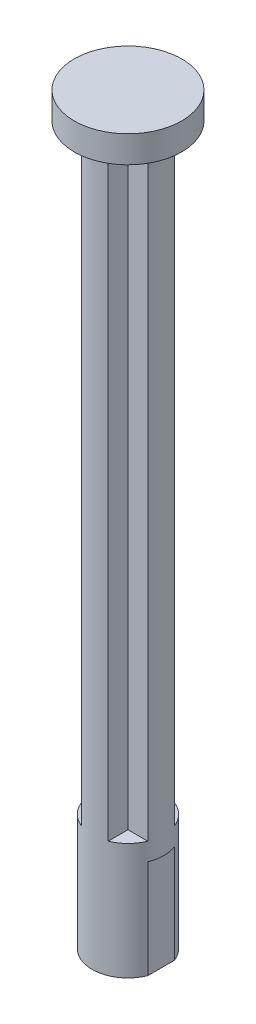
ISO-10303-21;
HEADER;
FILE_DESCRIPTION(('STEP AP214'),'2;1');
FILE_NAME('part.step','',(''),(''),'','','');
FILE_SCHEMA(('AUTOMOTIVE_DESIGN { 1 0 10303 214 1 1 1 1 }'));
ENDSEC;
DATA;
#1=APPLICATION_CONTEXT('core data for automotive mechanical design processes');
#2=APPLICATION_PROTOCOL_DEFINITION('international standard','automotive_design',2000,#1);
#3=PRODUCT_CONTEXT('',#1,'mechanical');
#4=PRODUCT('Part','Part','',(#3));
#5=PRODUCT_RELATED_PRODUCT_CATEGORY('part','',(#4));
#6=PRODUCT_DEFINITION_FORMATION('','',#4);
#7=PRODUCT_DEFINITION_CONTEXT('part definition',#1,'design');
#8=PRODUCT_DEFINITION('design','',#6,#7);
#9=PRODUCT_DEFINITION_SHAPE('','',#8);
#10=(LENGTH_UNIT() NAMED_UNIT(*) SI_UNIT(.MILLI.,.METRE.));
#11=(NAMED_UNIT(*) PLANE_ANGLE_UNIT() SI_UNIT($,.RADIAN.));
#12=(NAMED_UNIT(*) SI_UNIT($,.STERADIAN.) SOLID_ANGLE_UNIT());
#13=UNCERTAINTY_MEASURE_WITH_UNIT(LENGTH_MEASURE(1.E-05),#10,'distance_accuracy_value','');
#14=(GEOMETRIC_REPRESENTATION_CONTEXT(3) GLOBAL_UNCERTAINTY_ASSIGNED_CONTEXT((#13)) GLOBAL_UNIT_ASSIGNED_CONTEXT((#10,
#11,#12)) REPRESENTATION_CONTEXT('',''));
#15=CARTESIAN_POINT('',(0.,0.,0.));
#16=DIRECTION('',(0.,0.,1.));
#17=DIRECTION('',(1.,0.,0.));
#18=AXIS2_PLACEMENT_3D('',#15,#16,#17);
#19=CARTESIAN_POINT('',(0.,13.,0.));
#20=DIRECTION('',(0.,1.,0.));
#21=DIRECTION('',(0.,0.,1.));
#22=AXIS2_PLACEMENT_3D('',#19,#20,#21);
#23=PLANE('',#22);
#24=DIRECTION('',(0.,0.,-1.));
#25=VECTOR('',#24,1.);
#26=CARTESIAN_POINT('',(1.50000000000001,13.,-1.49999999999999));
#27=LINE('',#26,#25);
#28=CARTESIAN_POINT('',(1.50000000000001,13.,-1.49999999999999));
#29=VERTEX_POINT('',#28);
#30=CARTESIAN_POINT('',(1.50000000000001,13.,-3.70809924354782));
#31=VERTEX_POINT('',#30);
#32=EDGE_CURVE('E59',#29,#31,#27,.T.);
#33=ORIENTED_EDGE('',*,*,#32,.F.);
#34=DIRECTION('',(-1.,0.,0.));
#35=VECTOR('',#34,1.);
#36=CARTESIAN_POINT('',(1.50000000000001,13.,-1.49999999999999));
#37=LINE('',#36,#35);
#38=CARTESIAN_POINT('',(3.70809924354784,13.,-1.49999999999997));
#39=VERTEX_POINT('',#38);
#40=EDGE_CURVE('E223',#39,#29,#37,.T.);
#41=ORIENTED_EDGE('',*,*,#40,.F.);
#42=CARTESIAN_POINT('',(0.,13.,0.));
#43=DIRECTION('',(0.,1.,0.));
#44=DIRECTION('',(0.,0.,1.));
#45=AXIS2_PLACEMENT_3D('',#42,#43,#44);
#46=CIRCLE('',#45,4.);
#47=EDGE_CURVE('E310',#39,#31,#46,.T.);
#48=ORIENTED_EDGE('',*,*,#47,.T.);
#49=EDGE_LOOP('',(#33,#41,#48));
#50=FACE_BOUND('',#49,.T.);
#51=ADVANCED_FACE('F43',(#50),#23,.T.);
#52=DIRECTION('',(1.,0.,0.));
#53=VECTOR('',#52,1.);
#54=CARTESIAN_POINT('',(1.49999999999998,13.,1.50000000000001));
#55=LINE('',#54,#53);
#56=CARTESIAN_POINT('',(1.49999999999998,13.,1.50000000000001));
#57=VERTEX_POINT('',#56);
#58=CARTESIAN_POINT('',(3.70809924354782,13.,1.50000000000003));
#59=VERTEX_POINT('',#58);
#60=EDGE_CURVE('E67',#57,#59,#55,.T.);
#61=ORIENTED_EDGE('',*,*,#60,.F.);
#62=DIRECTION('',(0.,0.,-1.));
#63=VECTOR('',#62,1.);
#64=CARTESIAN_POINT('',(1.49999999999998,13.,1.50000000000001));
#65=LINE('',#64,#63);
#66=CARTESIAN_POINT('',(1.49999999999996,13.,3.70809924354785));
#67=VERTEX_POINT('',#66);
#68=EDGE_CURVE('E218',#67,#57,#65,.T.);
#69=ORIENTED_EDGE('',*,*,#68,.F.);
#70=EDGE_CURVE('E306',#67,#59,#46,.T.);
#71=ORIENTED_EDGE('',*,*,#70,.T.);
#72=EDGE_LOOP('',(#61,#69,#71));
#73=FACE_BOUND('',#72,.T.);
#74=ADVANCED_FACE('F403',(#73),#23,.T.);
#75=DIRECTION('',(0.,0.,1.));
#76=VECTOR('',#75,1.);
#77=CARTESIAN_POINT('',(-1.50000000000002,13.,1.5));
#78=LINE('',#77,#76);
#79=CARTESIAN_POINT('',(-1.50000000000002,13.,1.5));
#80=VERTEX_POINT('',#79);
#81=CARTESIAN_POINT('',(-1.50000000000004,13.,3.70809924354781));
#82=VERTEX_POINT('',#81);
#83=EDGE_CURVE('E214',#80,#82,#78,.T.);
#84=ORIENTED_EDGE('',*,*,#83,.F.);
#85=DIRECTION('',(1.,0.,0.));
#86=VECTOR('',#85,1.);
#87=CARTESIAN_POINT('',(-1.50000000000002,13.,1.5));
#88=LINE('',#87,#86);
#89=CARTESIAN_POINT('',(-3.70809924354783,13.,1.5));
#90=VERTEX_POINT('',#89);
#91=EDGE_CURVE('E210',#90,#80,#88,.T.);
#92=ORIENTED_EDGE('',*,*,#91,.F.);
#93=EDGE_CURVE('E311',#90,#82,#46,.T.);
#94=ORIENTED_EDGE('',*,*,#93,.T.);
#95=EDGE_LOOP('',(#84,#92,#94));
#96=FACE_BOUND('',#95,.T.);
#97=ADVANCED_FACE('F409',(#96),#23,.T.);
#98=CARTESIAN_POINT('',(-3.70809924354783,11.,-1.5));
#99=DIRECTION('',(1.,0.,0.));
#100=DIRECTION('',(0.,0.,-1.));
#101=AXIS2_PLACEMENT_3D('',#98,#99,#100);
#102=PLANE('',#101);
#103=DIRECTION('',(0.,-1.,0.));
#104=VECTOR('',#103,1.);
#105=CARTESIAN_POINT('',(-3.70809924354783,11.,-1.5));
#106=LINE('',#105,#104);
#107=CARTESIAN_POINT('',(-3.70809924354783,11.,-1.5));
#108=VERTEX_POINT('',#107);
#109=CARTESIAN_POINT('',(-3.70809924354783,5.,-1.5));
#110=VERTEX_POINT('',#109);
#111=EDGE_CURVE('E284',#108,#110,#106,.T.);
#112=ORIENTED_EDGE('',*,*,#111,.T.);
#113=CARTESIAN_POINT('',(-3.70809924354783,5.,0.));
#114=DIRECTION('',(-1.,0.,0.));
#115=DIRECTION('',(0.,0.,1.));
#116=AXIS2_PLACEMENT_3D('',#113,#114,#115);
#117=CIRCLE('',#116,1.5);
#118=CARTESIAN_POINT('',(-3.70809924354783,5.,1.5));
#119=VERTEX_POINT('',#118);
#120=EDGE_CURVE('E267',#119,#110,#117,.T.);
#121=ORIENTED_EDGE('',*,*,#120,.F.);
#122=DIRECTION('',(0.,-1.,0.));
#123=VECTOR('',#122,1.);
#124=CARTESIAN_POINT('',(-3.70809924354783,11.,1.5));
#125=LINE('',#124,#123);
#126=CARTESIAN_POINT('',(-3.70809924354783,11.,1.5));
#127=VERTEX_POINT('',#126);
#128=EDGE_CURVE('E289',#127,#119,#125,.T.);
#129=ORIENTED_EDGE('',*,*,#128,.F.);
#130=DIRECTION('',(0.,0.,1.));
#131=VECTOR('',#130,1.);
#132=CARTESIAN_POINT('',(-3.70809924354783,11.,-1.5));
#133=LINE('',#132,#131);
#134=EDGE_CURVE('E278',#108,#127,#133,.T.);
#135=ORIENTED_EDGE('',*,*,#134,.F.);
#136=EDGE_LOOP('',(#112,#121,#129,#135));
#137=FACE_BOUND('',#136,.T.);
#138=ADVANCED_FACE('F417',(#137),#102,.F.);
#139=CARTESIAN_POINT('',(0.,13.,0.));
#140=DIRECTION('',(0.,-1.,0.));
#141=DIRECTION('',(0.,0.,-1.));
#142=AXIS2_PLACEMENT_3D('',#139,#140,#141);
#143=CYLINDRICAL_SURFACE('',#142,4.);
#144=ORIENTED_EDGE('',*,*,#70,.F.);
#145=DIRECTION('',(0.,-1.,0.));
#146=VECTOR('',#145,1.);
#147=CARTESIAN_POINT('',(1.49999999999996,80.,3.70809924354784));
#148=LINE('',#147,#146);
#149=CARTESIAN_POINT('',(1.49999999999996,80.,3.70809924354784));
#150=VERTEX_POINT('',#149);
#151=EDGE_CURVE('E246',#150,#67,#148,.T.);
#152=ORIENTED_EDGE('',*,*,#151,.F.);
#153=CARTESIAN_POINT('',(0.,80.,0.));
#154=DIRECTION('',(0.,1.,0.));
#155=DIRECTION('',(0.,0.,1.));
#156=AXIS2_PLACEMENT_3D('',#153,#154,#155);
#157=CIRCLE('',#156,4.);
#158=CARTESIAN_POINT('',(-1.50000000000004,80.,3.70809924354781));
#159=VERTEX_POINT('',#158);
#160=EDGE_CURVE('E361',#159,#150,#157,.T.);
#161=ORIENTED_EDGE('',*,*,#160,.F.);
#162=DIRECTION('',(0.,-1.,0.));
#163=VECTOR('',#162,1.);
#164=CARTESIAN_POINT('',(-1.50000000000004,80.,3.70809924354781));
#165=LINE('',#164,#163);
#166=EDGE_CURVE('E250',#159,#82,#165,.T.);
#167=ORIENTED_EDGE('',*,*,#166,.T.);
#168=ORIENTED_EDGE('',*,*,#93,.F.);
#169=DIRECTION('',(0.,-1.,0.));
#170=VECTOR('',#169,1.);
#171=CARTESIAN_POINT('',(-3.70809924354783,80.,1.5));
#172=LINE('',#171,#170);
#173=CARTESIAN_POINT('',(-3.70809924354783,80.,1.5));
#174=VERTEX_POINT('',#173);
#175=EDGE_CURVE('E258',#174,#90,#172,.T.);
#176=ORIENTED_EDGE('',*,*,#175,.F.);
#177=CARTESIAN_POINT('',(0.,80.,0.));
#178=DIRECTION('',(0.,1.,0.));
#179=DIRECTION('',(0.,0.,1.));
#180=AXIS2_PLACEMENT_3D('',#177,#178,#179);
#181=CIRCLE('',#180,4.);
#182=CARTESIAN_POINT('',(-3.70809924354783,80.,-1.5));
#183=VERTEX_POINT('',#182);
#184=EDGE_CURVE('E375',#183,#174,#181,.T.);
#185=ORIENTED_EDGE('',*,*,#184,.F.);
#186=DIRECTION('',(0.,-1.,0.));
#187=VECTOR('',#186,1.);
#188=CARTESIAN_POINT('',(-3.70809924354783,80.,-1.5));
#189=LINE('',#188,#187);
#190=CARTESIAN_POINT('',(-3.70809924354783,13.,-1.5));
#191=VERTEX_POINT('',#190);
#192=EDGE_CURVE('E262',#183,#191,#189,.T.);
#193=ORIENTED_EDGE('',*,*,#192,.T.);
#194=CARTESIAN_POINT('',(-1.49999999999999,13.,-3.70809924354784));
#195=VERTEX_POINT('',#194);
#196=EDGE_CURVE('E186',#195,#191,#46,.T.);
#197=ORIENTED_EDGE('',*,*,#196,.F.);
#198=DIRECTION('',(0.,-1.,0.));
#199=VECTOR('',#198,1.);
#200=CARTESIAN_POINT('',(-1.49999999999999,80.,-3.70809924354784));
#201=LINE('',#200,#199);
#202=CARTESIAN_POINT('',(-1.49999999999999,80.,-3.70809924354784));
#203=VERTEX_POINT('',#202);
#204=EDGE_CURVE('E168',#203,#195,#201,.T.);
#205=ORIENTED_EDGE('',*,*,#204,.F.);
#206=CARTESIAN_POINT('',(0.,80.,0.));
#207=DIRECTION('',(0.,1.,0.));
#208=DIRECTION('',(0.,0.,1.));
#209=AXIS2_PLACEMENT_3D('',#206,#207,#208);
#210=CIRCLE('',#209,4.);
#211=CARTESIAN_POINT('',(1.50000000000001,80.,-3.70809924354782));
#212=VERTEX_POINT('',#211);
#213=EDGE_CURVE('E183',#212,#203,#210,.T.);
#214=ORIENTED_EDGE('',*,*,#213,.F.);
#215=DIRECTION('',(0.,-1.,0.));
#216=VECTOR('',#215,1.);
#217=CARTESIAN_POINT('',(1.50000000000001,80.,-3.70809924354782));
#218=LINE('',#217,#216);
#219=EDGE_CURVE('E188',#212,#31,#218,.T.);
#220=ORIENTED_EDGE('',*,*,#219,.T.);
#221=ORIENTED_EDGE('',*,*,#47,.F.);
#222=DIRECTION('',(0.,-1.,0.));
#223=VECTOR('',#222,1.);
#224=CARTESIAN_POINT('',(3.70809924354784,80.,-1.49999999999997));
#225=LINE('',#224,#223);
#226=CARTESIAN_POINT('',(3.70809924354784,80.,-1.49999999999997));
#227=VERTEX_POINT('',#226);
#228=EDGE_CURVE('E234',#227,#39,#225,.T.);
#229=ORIENTED_EDGE('',*,*,#228,.F.);
#230=CARTESIAN_POINT('',(0.,80.,0.));
#231=DIRECTION('',(0.,1.,0.));
#232=DIRECTION('',(0.,0.,1.));
#233=AXIS2_PLACEMENT_3D('',#230,#231,#232);
#234=CIRCLE('',#233,4.);
#235=CARTESIAN_POINT('',(3.70809924354782,80.,1.50000000000003));
#236=VERTEX_POINT('',#235);
#237=EDGE_CURVE('E347',#236,#227,#234,.T.);
#238=ORIENTED_EDGE('',*,*,#237,.F.);
#239=DIRECTION('',(0.,-1.,0.));
#240=VECTOR('',#239,1.);
#241=CARTESIAN_POINT('',(3.70809924354782,80.,1.50000000000003));
#242=LINE('',#241,#240);
#243=EDGE_CURVE('E238',#236,#59,#242,.T.);
#244=ORIENTED_EDGE('',*,*,#243,.T.);
#245=EDGE_LOOP('',(#144,#152,#161,#167,#168,#176,#185,#193,#197,#205,#214,#220,#221,#229,#238,#244));
#246=FACE_BOUND('',#245,.T.);
#247=CARTESIAN_POINT('',(0.,11.,0.));
#248=DIRECTION('',(0.,-1.,0.));
#249=DIRECTION('',(0.,0.,-1.));
#250=AXIS2_PLACEMENT_3D('',#247,#248,#249);
#251=CIRCLE('',#250,4.);
#252=EDGE_CURVE('E275',#127,#108,#251,.T.);
#253=ORIENTED_EDGE('',*,*,#252,.F.);
#254=ORIENTED_EDGE('',*,*,#128,.T.);
#255=CARTESIAN_POINT('',(-3.70809924354783,0.,1.5));
#256=VERTEX_POINT('',#255);
#257=EDGE_CURVE('E288',#119,#256,#125,.T.);
#258=ORIENTED_EDGE('',*,*,#257,.T.);
#259=CARTESIAN_POINT('',(0.,0.,0.));
#260=DIRECTION('',(0.,1.,0.));
#261=DIRECTION('',(0.,0.,1.));
#262=AXIS2_PLACEMENT_3D('',#259,#260,#261);
#263=CIRCLE('',#262,4.);
#264=CARTESIAN_POINT('',(3.70809924354783,0.,1.5));
#265=VERTEX_POINT('',#264);
#266=EDGE_CURVE('E293',#256,#265,#263,.T.);
#267=ORIENTED_EDGE('',*,*,#266,.T.);
#268=DIRECTION('',(0.,-1.,0.));
#269=VECTOR('',#268,1.);
#270=CARTESIAN_POINT('',(3.70809924354783,11.,1.5));
#271=LINE('',#270,#269);
#272=CARTESIAN_POINT('',(3.70809924354783,11.,1.5));
#273=VERTEX_POINT('',#272);
#274=EDGE_CURVE('E297',#273,#265,#271,.T.);
#275=ORIENTED_EDGE('',*,*,#274,.F.);
#276=CARTESIAN_POINT('',(0.,11.,0.));
#277=DIRECTION('',(0.,-1.,0.));
#278=DIRECTION('',(0.,0.,-1.));
#279=AXIS2_PLACEMENT_3D('',#276,#277,#278);
#280=CIRCLE('',#279,4.);
#281=CARTESIAN_POINT('',(3.70809924354783,11.,-1.5));
#282=VERTEX_POINT('',#281);
#283=EDGE_CURVE('E279',#282,#273,#280,.T.);
#284=ORIENTED_EDGE('',*,*,#283,.F.);
#285=DIRECTION('',(0.,-1.,0.));
#286=VECTOR('',#285,1.);
#287=CARTESIAN_POINT('',(3.70809924354783,11.,-1.5));
#288=LINE('',#287,#286);
#289=CARTESIAN_POINT('',(3.70809924354783,0.,-1.5));
#290=VERTEX_POINT('',#289);
#291=EDGE_CURVE('E272',#282,#290,#288,.T.);
#292=ORIENTED_EDGE('',*,*,#291,.T.);
#293=CARTESIAN_POINT('',(-3.70809924354783,0.,-1.5));
#294=VERTEX_POINT('',#293);
#295=EDGE_CURVE('E315',#290,#294,#263,.T.);
#296=ORIENTED_EDGE('',*,*,#295,.T.);
#297=EDGE_CURVE('E283',#110,#294,#106,.T.);
#298=ORIENTED_EDGE('',*,*,#297,.F.);
#299=ORIENTED_EDGE('',*,*,#111,.F.);
#300=EDGE_LOOP('',(#253,#254,#258,#267,#275,#284,#292,#296,#298,#299));
#301=FACE_BOUND('',#300,.T.);
#302=ADVANCED_FACE('F45',(#246,#301),#143,.T.);
#303=DIRECTION('',(0.,0.,1.));
#304=VECTOR('',#303,1.);
#305=CARTESIAN_POINT('',(-1.49999999999999,13.,-1.5));
#306=LINE('',#305,#304);
#307=CARTESIAN_POINT('',(-1.49999999999999,13.,-1.5));
#308=VERTEX_POINT('',#307);
#309=EDGE_CURVE('E202',#195,#308,#306,.T.);
#310=ORIENTED_EDGE('',*,*,#309,.F.);
#311=ORIENTED_EDGE('',*,*,#196,.T.);
#312=DIRECTION('',(-1.,0.,0.));
#313=VECTOR('',#312,1.);
#314=CARTESIAN_POINT('',(-1.49999999999999,13.,-1.5));
#315=LINE('',#314,#313);
#316=EDGE_CURVE('E205',#308,#191,#315,.T.);
#317=ORIENTED_EDGE('',*,*,#316,.F.);
#318=EDGE_LOOP('',(#310,#311,#317));
#319=FACE_BOUND('',#318,.T.);
#320=ADVANCED_FACE('F405',(#319),#23,.T.);
#321=CARTESIAN_POINT('',(0.,0.,0.));
#322=DIRECTION('',(0.,1.,0.));
#323=DIRECTION('',(0.,0.,1.));
#324=AXIS2_PLACEMENT_3D('',#321,#322,#323);
#325=PLANE('',#324);
#326=ORIENTED_EDGE('',*,*,#266,.F.);
#327=DIRECTION('',(0.,0.,1.));
#328=VECTOR('',#327,1.);
#329=CARTESIAN_POINT('',(-3.70809924354783,0.,0.));
#330=LINE('',#329,#328);
#331=EDGE_CURVE('E52',#256,#294,#330,.F.);
#332=ORIENTED_EDGE('',*,*,#331,.T.);
#333=ORIENTED_EDGE('',*,*,#295,.F.);
#334=DIRECTION('',(0.,0.,1.));
#335=VECTOR('',#334,1.);
#336=CARTESIAN_POINT('',(3.70809924354783,0.,0.));
#337=LINE('',#336,#335);
#338=EDGE_CURVE('E309',#290,#265,#337,.T.);
#339=ORIENTED_EDGE('',*,*,#338,.T.);
#340=EDGE_LOOP('',(#326,#332,#333,#339));
#341=FACE_BOUND('',#340,.T.);
#342=ADVANCED_FACE('F325',(#341),#325,.F.);
#343=CARTESIAN_POINT('',(3.70809924354783,11.,-1.5));
#344=DIRECTION('',(-1.,0.,0.));
#345=DIRECTION('',(0.,0.,1.));
#346=AXIS2_PLACEMENT_3D('',#343,#344,#345);
#347=PLANE('',#346);
#348=ORIENTED_EDGE('',*,*,#291,.F.);
#349=DIRECTION('',(0.,0.,-1.));
#350=VECTOR('',#349,1.);
#351=CARTESIAN_POINT('',(3.70809924354783,11.,-1.5));
#352=LINE('',#351,#350);
#353=EDGE_CURVE('E300',#273,#282,#352,.T.);
#354=ORIENTED_EDGE('',*,*,#353,.F.);
#355=ORIENTED_EDGE('',*,*,#274,.T.);
#356=ORIENTED_EDGE('',*,*,#338,.F.);
#357=EDGE_LOOP('',(#348,#354,#355,#356));
#358=FACE_BOUND('',#357,.T.);
#359=ADVANCED_FACE('F416',(#358),#347,.F.);
#360=CARTESIAN_POINT('',(0.,11.,0.));
#361=DIRECTION('',(0.,-1.,0.));
#362=DIRECTION('',(0.,0.,-1.));
#363=AXIS2_PLACEMENT_3D('',#360,#361,#362);
#364=PLANE('',#363);
#365=ORIENTED_EDGE('',*,*,#283,.T.);
#366=ORIENTED_EDGE('',*,*,#353,.T.);
#367=EDGE_LOOP('',(#365,#366));
#368=FACE_BOUND('',#367,.T.);
#369=ADVANCED_FACE('F469',(#368),#364,.T.);
#370=ORIENTED_EDGE('',*,*,#257,.F.);
#371=CARTESIAN_POINT('',(-3.70809924354783,5.,0.));
#372=DIRECTION('',(1.,0.,0.));
#373=DIRECTION('',(0.,0.,-1.));
#374=AXIS2_PLACEMENT_3D('',#371,#372,#373);
#375=CIRCLE('',#374,1.5);
#376=EDGE_CURVE('E11',#119,#110,#375,.T.);
#377=ORIENTED_EDGE('',*,*,#376,.T.);
#378=ORIENTED_EDGE('',*,*,#297,.T.);
#379=ORIENTED_EDGE('',*,*,#331,.F.);
#380=EDGE_LOOP('',(#370,#377,#378,#379));
#381=FACE_BOUND('',#380,.T.);
#382=ADVANCED_FACE('F424',(#381),#102,.F.);
#383=CARTESIAN_POINT('',(0.,11.,0.));
#384=DIRECTION('',(0.,-1.,0.));
#385=DIRECTION('',(0.,0.,-1.));
#386=AXIS2_PLACEMENT_3D('',#383,#384,#385);
#387=PLANE('',#386);
#388=ORIENTED_EDGE('',*,*,#252,.T.);
#389=ORIENTED_EDGE('',*,*,#134,.T.);
#390=EDGE_LOOP('',(#388,#389));
#391=FACE_BOUND('',#390,.T.);
#392=ADVANCED_FACE('F463',(#391),#387,.T.);
#393=CARTESIAN_POINT('',(-0.708099243547831,5.,0.));
#394=DIRECTION('',(-1.,0.,0.));
#395=DIRECTION('',(0.,0.,1.));
#396=AXIS2_PLACEMENT_3D('',#393,#394,#395);
#397=CYLINDRICAL_SURFACE('',#396,1.5);
#398=CARTESIAN_POINT('',(-0.708099243547831,5.,0.));
#399=DIRECTION('',(-1.,0.,0.));
#400=DIRECTION('',(0.,0.,1.));
#401=AXIS2_PLACEMENT_3D('',#398,#399,#400);
#402=CIRCLE('',#401,1.5);
#403=CARTESIAN_POINT('',(-0.708099243547831,5.,1.5));
#404=VERTEX_POINT('',#403);
#405=EDGE_CURVE('E268',#404,#404,#402,.T.);
#406=ORIENTED_EDGE('',*,*,#405,.F.);
#407=EDGE_LOOP('',(#406));
#408=FACE_BOUND('',#407,.T.);
#409=ORIENTED_EDGE('',*,*,#120,.T.);
#410=ORIENTED_EDGE('',*,*,#376,.F.);
#411=EDGE_LOOP('',(#409,#410));
#412=FACE_BOUND('',#411,.T.);
#413=ADVANCED_FACE('F459',(#408,#412),#397,.F.);
#414=CARTESIAN_POINT('',(-0.708099243547831,5.,0.));
#415=DIRECTION('',(-1.,0.,0.));
#416=DIRECTION('',(0.,0.,1.));
#417=AXIS2_PLACEMENT_3D('',#414,#415,#416);
#418=PLANE('',#417);
#419=ORIENTED_EDGE('',*,*,#405,.T.);
#420=EDGE_LOOP('',(#419));
#421=FACE_BOUND('',#420,.T.);
#422=ADVANCED_FACE('F456',(#421),#418,.T.);
#423=CARTESIAN_POINT('',(-1.49999999999999,80.,-1.5));
#424=DIRECTION('',(1.,0.,0.));
#425=DIRECTION('',(0.,0.,-1.));
#426=AXIS2_PLACEMENT_3D('',#423,#424,#425);
#427=PLANE('',#426);
#428=ORIENTED_EDGE('',*,*,#309,.T.);
#429=DIRECTION('',(0.,-1.,0.));
#430=VECTOR('',#429,1.);
#431=CARTESIAN_POINT('',(-1.49999999999999,80.,-1.5));
#432=LINE('',#431,#430);
#433=CARTESIAN_POINT('',(-1.49999999999999,80.,-1.5));
#434=VERTEX_POINT('',#433);
#435=EDGE_CURVE('E170',#434,#308,#432,.T.);
#436=ORIENTED_EDGE('',*,*,#435,.F.);
#437=DIRECTION('',(0.,0.,1.));
#438=VECTOR('',#437,1.);
#439=CARTESIAN_POINT('',(-1.49999999999999,80.,-1.5));
#440=LINE('',#439,#438);
#441=EDGE_CURVE('E164',#203,#434,#440,.T.);
#442=ORIENTED_EDGE('',*,*,#441,.F.);
#443=ORIENTED_EDGE('',*,*,#204,.T.);
#444=EDGE_LOOP('',(#428,#436,#442,#443));
#445=FACE_BOUND('',#444,.T.);
#446=ADVANCED_FACE('F167',(#445),#427,.F.);
#447=CARTESIAN_POINT('',(-1.49999999999999,80.,-1.5));
#448=DIRECTION('',(0.,0.,1.));
#449=DIRECTION('',(1.,0.,0.));
#450=AXIS2_PLACEMENT_3D('',#447,#448,#449);
#451=PLANE('',#450);
#452=ORIENTED_EDGE('',*,*,#316,.T.);
#453=ORIENTED_EDGE('',*,*,#192,.F.);
#454=DIRECTION('',(-1.,0.,0.));
#455=VECTOR('',#454,1.);
#456=CARTESIAN_POINT('',(-1.49999999999999,80.,-1.5));
#457=LINE('',#456,#455);
#458=EDGE_CURVE('E175',#434,#183,#457,.T.);
#459=ORIENTED_EDGE('',*,*,#458,.F.);
#460=ORIENTED_EDGE('',*,*,#435,.T.);
#461=EDGE_LOOP('',(#452,#453,#459,#460));
#462=FACE_BOUND('',#461,.T.);
#463=ADVANCED_FACE('F450',(#462),#451,.F.);
#464=CARTESIAN_POINT('',(-1.50000000000002,80.,1.5));
#465=DIRECTION('',(0.,0.,-1.));
#466=DIRECTION('',(-1.,0.,0.));
#467=AXIS2_PLACEMENT_3D('',#464,#465,#466);
#468=PLANE('',#467);
#469=ORIENTED_EDGE('',*,*,#91,.T.);
#470=DIRECTION('',(0.,-1.,0.));
#471=VECTOR('',#470,1.);
#472=CARTESIAN_POINT('',(-1.50000000000002,80.,1.5));
#473=LINE('',#472,#471);
#474=CARTESIAN_POINT('',(-1.50000000000002,80.,1.5));
#475=VERTEX_POINT('',#474);
#476=EDGE_CURVE('E254',#475,#80,#473,.T.);
#477=ORIENTED_EDGE('',*,*,#476,.F.);
#478=DIRECTION('',(1.,0.,0.));
#479=VECTOR('',#478,1.);
#480=CARTESIAN_POINT('',(-1.50000000000002,80.,1.5));
#481=LINE('',#480,#479);
#482=EDGE_CURVE('E371',#174,#475,#481,.T.);
#483=ORIENTED_EDGE('',*,*,#482,.F.);
#484=ORIENTED_EDGE('',*,*,#175,.T.);
#485=EDGE_LOOP('',(#469,#477,#483,#484));
#486=FACE_BOUND('',#485,.T.);
#487=ADVANCED_FACE('F427',(#486),#468,.F.);
#488=CARTESIAN_POINT('',(-1.50000000000002,80.,1.5));
#489=DIRECTION('',(1.,0.,0.));
#490=DIRECTION('',(0.,0.,-1.));
#491=AXIS2_PLACEMENT_3D('',#488,#489,#490);
#492=PLANE('',#491);
#493=ORIENTED_EDGE('',*,*,#83,.T.);
#494=ORIENTED_EDGE('',*,*,#166,.F.);
#495=DIRECTION('',(0.,0.,1.));
#496=VECTOR('',#495,1.);
#497=CARTESIAN_POINT('',(-1.50000000000002,80.,1.5));
#498=LINE('',#497,#496);
#499=EDGE_CURVE('E367',#475,#159,#498,.T.);
#500=ORIENTED_EDGE('',*,*,#499,.F.);
#501=ORIENTED_EDGE('',*,*,#476,.T.);
#502=EDGE_LOOP('',(#493,#494,#500,#501));
#503=FACE_BOUND('',#502,.T.);
#504=ADVANCED_FACE('F430',(#503),#492,.F.);
#505=CARTESIAN_POINT('',(1.49999999999998,80.,1.50000000000001));
#506=DIRECTION('',(-1.,0.,0.));
#507=DIRECTION('',(0.,0.,1.));
#508=AXIS2_PLACEMENT_3D('',#505,#506,#507);
#509=PLANE('',#508);
#510=ORIENTED_EDGE('',*,*,#68,.T.);
#511=DIRECTION('',(0.,-1.,0.));
#512=VECTOR('',#511,1.);
#513=CARTESIAN_POINT('',(1.49999999999998,80.,1.50000000000001));
#514=LINE('',#513,#512);
#515=CARTESIAN_POINT('',(1.49999999999998,80.,1.50000000000001));
#516=VERTEX_POINT('',#515);
#517=EDGE_CURVE('E242',#516,#57,#514,.T.);
#518=ORIENTED_EDGE('',*,*,#517,.F.);
#519=DIRECTION('',(0.,0.,-1.));
#520=VECTOR('',#519,1.);
#521=CARTESIAN_POINT('',(1.49999999999998,80.,1.50000000000001));
#522=LINE('',#521,#520);
#523=EDGE_CURVE('E356',#150,#516,#522,.T.);
#524=ORIENTED_EDGE('',*,*,#523,.F.);
#525=ORIENTED_EDGE('',*,*,#151,.T.);
#526=EDGE_LOOP('',(#510,#518,#524,#525));
#527=FACE_BOUND('',#526,.T.);
#528=ADVANCED_FACE('F434',(#527),#509,.F.);
#529=CARTESIAN_POINT('',(1.49999999999998,80.,1.50000000000001));
#530=DIRECTION('',(0.,0.,-1.));
#531=DIRECTION('',(-1.,0.,0.));
#532=AXIS2_PLACEMENT_3D('',#529,#530,#531);
#533=PLANE('',#532);
#534=ORIENTED_EDGE('',*,*,#60,.T.);
#535=ORIENTED_EDGE('',*,*,#243,.F.);
#536=DIRECTION('',(1.,0.,0.));
#537=VECTOR('',#536,1.);
#538=CARTESIAN_POINT('',(1.49999999999998,80.,1.50000000000001));
#539=LINE('',#538,#537);
#540=EDGE_CURVE('E350',#516,#236,#539,.T.);
#541=ORIENTED_EDGE('',*,*,#540,.F.);
#542=ORIENTED_EDGE('',*,*,#517,.T.);
#543=EDGE_LOOP('',(#534,#535,#541,#542));
#544=FACE_BOUND('',#543,.T.);
#545=ADVANCED_FACE('F435',(#544),#533,.F.);
#546=CARTESIAN_POINT('',(1.50000000000001,80.,-1.49999999999999));
#547=DIRECTION('',(0.,0.,1.));
#548=DIRECTION('',(1.,0.,0.));
#549=AXIS2_PLACEMENT_3D('',#546,#547,#548);
#550=PLANE('',#549);
#551=ORIENTED_EDGE('',*,*,#40,.T.);
#552=DIRECTION('',(0.,-1.,0.));
#553=VECTOR('',#552,1.);
#554=CARTESIAN_POINT('',(1.50000000000001,80.,-1.49999999999999));
#555=LINE('',#554,#553);
#556=CARTESIAN_POINT('',(1.50000000000001,80.,-1.49999999999999));
#557=VERTEX_POINT('',#556);
#558=EDGE_CURVE('E230',#557,#29,#555,.T.);
#559=ORIENTED_EDGE('',*,*,#558,.F.);
#560=DIRECTION('',(-1.,0.,0.));
#561=VECTOR('',#560,1.);
#562=CARTESIAN_POINT('',(1.50000000000001,80.,-1.49999999999999));
#563=LINE('',#562,#561);
#564=EDGE_CURVE('E198',#227,#557,#563,.T.);
#565=ORIENTED_EDGE('',*,*,#564,.F.);
#566=ORIENTED_EDGE('',*,*,#228,.T.);
#567=EDGE_LOOP('',(#551,#559,#565,#566));
#568=FACE_BOUND('',#567,.T.);
#569=ADVANCED_FACE('F344',(#568),#550,.F.);
#570=CARTESIAN_POINT('',(1.50000000000001,80.,-1.49999999999999));
#571=DIRECTION('',(-1.,0.,0.));
#572=DIRECTION('',(0.,0.,1.));
#573=AXIS2_PLACEMENT_3D('',#570,#571,#572);
#574=PLANE('',#573);
#575=ORIENTED_EDGE('',*,*,#32,.T.);
#576=ORIENTED_EDGE('',*,*,#219,.F.);
#577=DIRECTION('',(0.,0.,-1.));
#578=VECTOR('',#577,1.);
#579=CARTESIAN_POINT('',(1.50000000000001,80.,-1.49999999999999));
#580=LINE('',#579,#578);
#581=EDGE_CURVE('E194',#557,#212,#580,.T.);
#582=ORIENTED_EDGE('',*,*,#581,.F.);
#583=ORIENTED_EDGE('',*,*,#558,.T.);
#584=EDGE_LOOP('',(#575,#576,#582,#583));
#585=FACE_BOUND('',#584,.T.);
#586=ADVANCED_FACE('F341',(#585),#574,.F.);
#587=CARTESIAN_POINT('',(0.,83.,0.));
#588=DIRECTION('',(0.,-1.,0.));
#589=DIRECTION('',(0.,0.,-1.));
#590=AXIS2_PLACEMENT_3D('',#587,#588,#589);
#591=CYLINDRICAL_SURFACE('',#590,6.);
#592=CARTESIAN_POINT('',(0.,83.,0.));
#593=DIRECTION('',(0.,1.,0.));
#594=DIRECTION('',(0.,0.,1.));
#595=AXIS2_PLACEMENT_3D('',#592,#593,#594);
#596=CIRCLE('',#595,6.);
#597=CARTESIAN_POINT('',(0.,83.,6.));
#598=VERTEX_POINT('',#597);
#599=EDGE_CURVE('E206',#598,#598,#596,.T.);
#600=ORIENTED_EDGE('',*,*,#599,.F.);
#601=EDGE_LOOP('',(#600));
#602=FACE_BOUND('',#601,.T.);
#603=CARTESIAN_POINT('',(0.,80.,0.));
#604=DIRECTION('',(0.,1.,0.));
#605=DIRECTION('',(0.,0.,1.));
#606=AXIS2_PLACEMENT_3D('',#603,#604,#605);
#607=CIRCLE('',#606,6.);
#608=CARTESIAN_POINT('',(0.,80.,6.));
#609=VERTEX_POINT('',#608);
#610=EDGE_CURVE('E381',#609,#609,#607,.T.);
#611=ORIENTED_EDGE('',*,*,#610,.T.);
#612=EDGE_LOOP('',(#611));
#613=FACE_BOUND('',#612,.T.);
#614=ADVANCED_FACE('F391',(#602,#613),#591,.T.);
#615=CARTESIAN_POINT('',(0.,83.,0.));
#616=DIRECTION('',(0.,1.,0.));
#617=DIRECTION('',(0.,0.,1.));
#618=AXIS2_PLACEMENT_3D('',#615,#616,#617);
#619=PLANE('',#618);
#620=ORIENTED_EDGE('',*,*,#599,.T.);
#621=EDGE_LOOP('',(#620));
#622=FACE_BOUND('',#621,.T.);
#623=ADVANCED_FACE('F389',(#622),#619,.T.);
#624=CARTESIAN_POINT('',(0.,80.,0.));
#625=DIRECTION('',(0.,1.,0.));
#626=DIRECTION('',(0.,0.,1.));
#627=AXIS2_PLACEMENT_3D('',#624,#625,#626);
#628=PLANE('',#627);
#629=ORIENTED_EDGE('',*,*,#213,.T.);
#630=ORIENTED_EDGE('',*,*,#441,.T.);
#631=ORIENTED_EDGE('',*,*,#458,.T.);
#632=ORIENTED_EDGE('',*,*,#184,.T.);
#633=ORIENTED_EDGE('',*,*,#482,.T.);
#634=ORIENTED_EDGE('',*,*,#499,.T.);
#635=ORIENTED_EDGE('',*,*,#160,.T.);
#636=ORIENTED_EDGE('',*,*,#523,.T.);
#637=ORIENTED_EDGE('',*,*,#540,.T.);
#638=ORIENTED_EDGE('',*,*,#237,.T.);
#639=ORIENTED_EDGE('',*,*,#564,.T.);
#640=ORIENTED_EDGE('',*,*,#581,.T.);
#641=EDGE_LOOP('',(#629,#630,#631,#632,#633,#634,#635,#636,#637,#638,#639,#640));
#642=FACE_BOUND('',#641,.T.);
#643=ORIENTED_EDGE('',*,*,#610,.F.);
#644=EDGE_LOOP('',(#643));
#645=FACE_BOUND('',#644,.T.);
#646=ADVANCED_FACE('F190',(#642,#645),#628,.F.);
#647=CLOSED_SHELL('',(#51,#74,#97,#138,#302,#320,#342,#359,#369,#382,#392,#413,#422,#446,#463,
#487,#504,#528,#545,#569,#586,#614,#623,#646));
#648=MANIFOLD_SOLID_BREP('B2',#647);
#649=ADVANCED_BREP_SHAPE_REPRESENTATION('',(#18,#648),#14);
#650=SHAPE_DEFINITION_REPRESENTATION(#9,#649);
ENDSEC;
END-ISO-10303-21;
